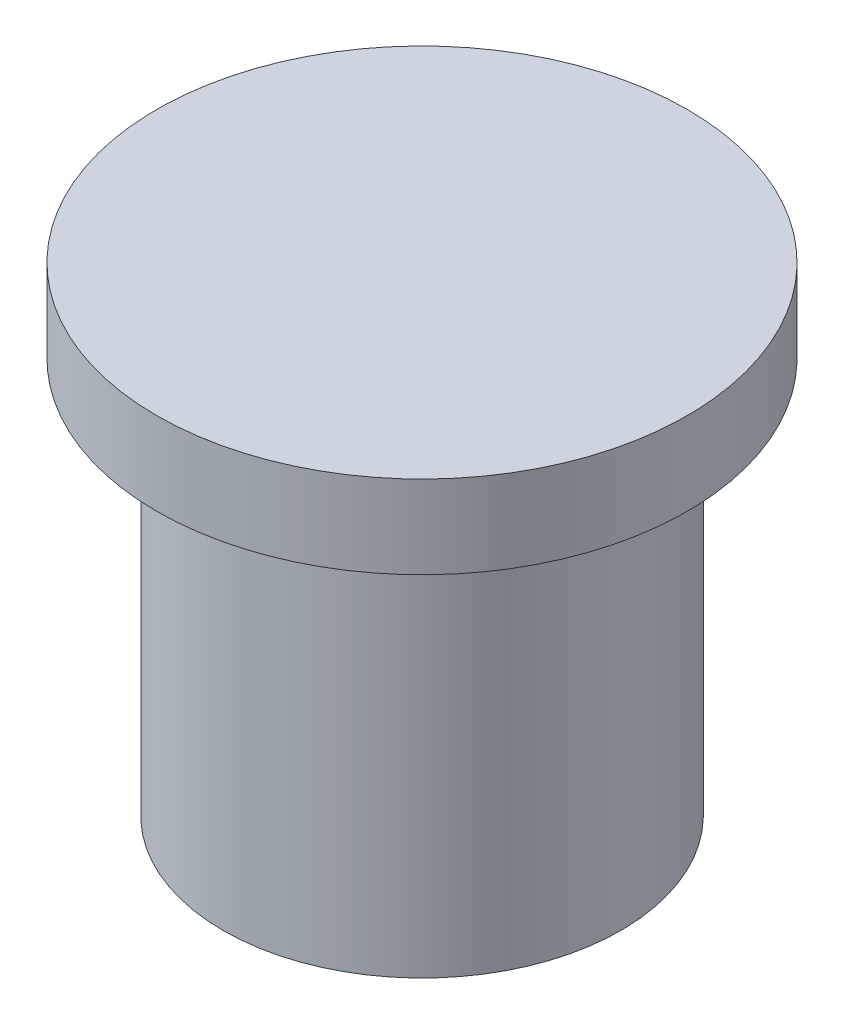
ISO-10303-21;
HEADER;
FILE_DESCRIPTION(('STEP AP214'),'2;1');
FILE_NAME('part.step','',(''),(''),'','','');
FILE_SCHEMA(('AUTOMOTIVE_DESIGN { 1 0 10303 214 1 1 1 1 }'));
ENDSEC;
DATA;
#1=APPLICATION_CONTEXT('core data for automotive mechanical design processes');
#2=APPLICATION_PROTOCOL_DEFINITION('international standard','automotive_design',2000,#1);
#3=PRODUCT_CONTEXT('',#1,'mechanical');
#4=PRODUCT('Part','Part','',(#3));
#5=PRODUCT_RELATED_PRODUCT_CATEGORY('part','',(#4));
#6=PRODUCT_DEFINITION_FORMATION('','',#4);
#7=PRODUCT_DEFINITION_CONTEXT('part definition',#1,'design');
#8=PRODUCT_DEFINITION('design','',#6,#7);
#9=PRODUCT_DEFINITION_SHAPE('','',#8);
#10=(LENGTH_UNIT() NAMED_UNIT(*) SI_UNIT(.MILLI.,.METRE.));
#11=(NAMED_UNIT(*) PLANE_ANGLE_UNIT() SI_UNIT($,.RADIAN.));
#12=(NAMED_UNIT(*) SI_UNIT($,.STERADIAN.) SOLID_ANGLE_UNIT());
#13=UNCERTAINTY_MEASURE_WITH_UNIT(LENGTH_MEASURE(1.E-05),#10,'distance_accuracy_value','');
#14=(GEOMETRIC_REPRESENTATION_CONTEXT(3) GLOBAL_UNCERTAINTY_ASSIGNED_CONTEXT((#13)) GLOBAL_UNIT_ASSIGNED_CONTEXT((#10,
#11,#12)) REPRESENTATION_CONTEXT('',''));
#15=CARTESIAN_POINT('',(0.,0.,0.));
#16=DIRECTION('',(0.,0.,1.));
#17=DIRECTION('',(1.,0.,0.));
#18=AXIS2_PLACEMENT_3D('',#15,#16,#17);
#19=CARTESIAN_POINT('',(0.,15.175,0.));
#20=DIRECTION('',(0.,-1.,0.));
#21=DIRECTION('',(0.,0.,-1.));
#22=AXIS2_PLACEMENT_3D('',#19,#20,#21);
#23=CYLINDRICAL_SURFACE('',#22,7.62);
#24=CARTESIAN_POINT('',(0.,15.175,0.));
#25=DIRECTION('',(0.,1.,0.));
#26=DIRECTION('',(0.,0.,1.));
#27=AXIS2_PLACEMENT_3D('',#24,#25,#26);
#28=CIRCLE('',#27,7.62);
#29=CARTESIAN_POINT('',(0.,15.175,7.62));
#30=VERTEX_POINT('',#29);
#31=EDGE_CURVE('E10',#30,#30,#28,.T.);
#32=ORIENTED_EDGE('',*,*,#31,.F.);
#33=EDGE_LOOP('',(#32));
#34=FACE_BOUND('',#33,.T.);
#35=CARTESIAN_POINT('',(0.,0.,0.));
#36=DIRECTION('',(0.,1.,0.));
#37=DIRECTION('',(0.,0.,1.));
#38=AXIS2_PLACEMENT_3D('',#35,#36,#37);
#39=CIRCLE('',#38,7.62);
#40=CARTESIAN_POINT('',(0.,0.,7.62));
#41=VERTEX_POINT('',#40);
#42=EDGE_CURVE('E37',#41,#41,#39,.T.);
#43=ORIENTED_EDGE('',*,*,#42,.T.);
#44=EDGE_LOOP('',(#43));
#45=FACE_BOUND('',#44,.T.);
#46=ADVANCED_FACE('F34',(#34,#45),#23,.T.);
#47=CARTESIAN_POINT('',(0.,0.,0.));
#48=DIRECTION('',(0.,1.,0.));
#49=DIRECTION('',(0.,0.,1.));
#50=AXIS2_PLACEMENT_3D('',#47,#48,#49);
#51=PLANE('',#50);
#52=ORIENTED_EDGE('',*,*,#42,.F.);
#53=EDGE_LOOP('',(#52));
#54=FACE_BOUND('',#53,.T.);
#55=ADVANCED_FACE('F57',(#54),#51,.F.);
#56=CARTESIAN_POINT('',(0.,18.35,0.));
#57=DIRECTION('',(0.,-1.,0.));
#58=DIRECTION('',(0.,0.,-1.));
#59=AXIS2_PLACEMENT_3D('',#56,#57,#58);
#60=CYLINDRICAL_SURFACE('',#59,10.16);
#61=CARTESIAN_POINT('',(0.,18.35,0.));
#62=DIRECTION('',(0.,1.,0.));
#63=DIRECTION('',(0.,0.,1.));
#64=AXIS2_PLACEMENT_3D('',#61,#62,#63);
#65=CIRCLE('',#64,10.16);
#66=CARTESIAN_POINT('',(0.,18.35,10.16));
#67=VERTEX_POINT('',#66);
#68=EDGE_CURVE('E44',#67,#67,#65,.T.);
#69=ORIENTED_EDGE('',*,*,#68,.F.);
#70=EDGE_LOOP('',(#69));
#71=FACE_BOUND('',#70,.T.);
#72=CARTESIAN_POINT('',(0.,15.175,0.));
#73=DIRECTION('',(0.,1.,0.));
#74=DIRECTION('',(0.,0.,1.));
#75=AXIS2_PLACEMENT_3D('',#72,#73,#74);
#76=CIRCLE('',#75,10.16);
#77=CARTESIAN_POINT('',(0.,15.175,10.16));
#78=VERTEX_POINT('',#77);
#79=EDGE_CURVE('E46',#78,#78,#76,.T.);
#80=ORIENTED_EDGE('',*,*,#79,.T.);
#81=EDGE_LOOP('',(#80));
#82=FACE_BOUND('',#81,.T.);
#83=ADVANCED_FACE('F54',(#71,#82),#60,.T.);
#84=CARTESIAN_POINT('',(0.,18.35,0.));
#85=DIRECTION('',(0.,1.,0.));
#86=DIRECTION('',(0.,0.,1.));
#87=AXIS2_PLACEMENT_3D('',#84,#85,#86);
#88=PLANE('',#87);
#89=ORIENTED_EDGE('',*,*,#68,.T.);
#90=EDGE_LOOP('',(#89));
#91=FACE_BOUND('',#90,.T.);
#92=ADVANCED_FACE('F52',(#91),#88,.T.);
#93=CARTESIAN_POINT('',(0.,15.175,0.));
#94=DIRECTION('',(0.,1.,0.));
#95=DIRECTION('',(0.,0.,1.));
#96=AXIS2_PLACEMENT_3D('',#93,#94,#95);
#97=PLANE('',#96);
#98=ORIENTED_EDGE('',*,*,#31,.T.);
#99=EDGE_LOOP('',(#98));
#100=FACE_BOUND('',#99,.T.);
#101=ORIENTED_EDGE('',*,*,#79,.F.);
#102=EDGE_LOOP('',(#101));
#103=FACE_BOUND('',#102,.T.);
#104=ADVANCED_FACE('F61',(#100,#103),#97,.F.);
#105=CLOSED_SHELL('',(#46,#55,#83,#92,#104));
#106=MANIFOLD_SOLID_BREP('B2',#105);
#107=ADVANCED_BREP_SHAPE_REPRESENTATION('',(#18,#106),#14);
#108=SHAPE_DEFINITION_REPRESENTATION(#9,#107);
ENDSEC;
END-ISO-10303-21;
